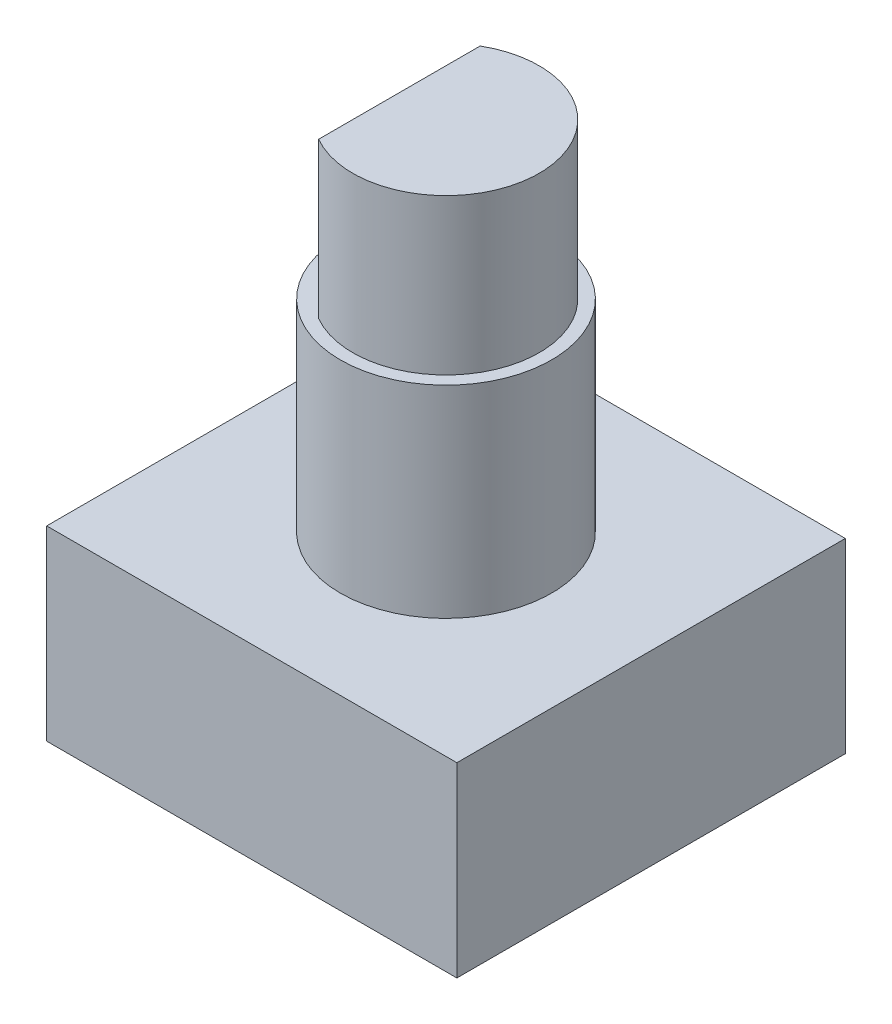
ISO-10303-21;
HEADER;
FILE_DESCRIPTION(('STEP AP214'),'2;1');
FILE_NAME('part.step','',(''),(''),'','','');
FILE_SCHEMA(('AUTOMOTIVE_DESIGN { 1 0 10303 214 1 1 1 1 }'));
ENDSEC;
DATA;
#1=APPLICATION_CONTEXT('core data for automotive mechanical design processes');
#2=APPLICATION_PROTOCOL_DEFINITION('international standard','automotive_design',2000,#1);
#3=PRODUCT_CONTEXT('',#1,'mechanical');
#4=PRODUCT('Part','Part','',(#3));
#5=PRODUCT_RELATED_PRODUCT_CATEGORY('part','',(#4));
#6=PRODUCT_DEFINITION_FORMATION('','',#4);
#7=PRODUCT_DEFINITION_CONTEXT('part definition',#1,'design');
#8=PRODUCT_DEFINITION('design','',#6,#7);
#9=PRODUCT_DEFINITION_SHAPE('','',#8);
#10=(LENGTH_UNIT() NAMED_UNIT(*) SI_UNIT(.MILLI.,.METRE.));
#11=(NAMED_UNIT(*) PLANE_ANGLE_UNIT() SI_UNIT($,.RADIAN.));
#12=(NAMED_UNIT(*) SI_UNIT($,.STERADIAN.) SOLID_ANGLE_UNIT());
#13=UNCERTAINTY_MEASURE_WITH_UNIT(LENGTH_MEASURE(1.E-05),#10,'distance_accuracy_value','');
#14=(GEOMETRIC_REPRESENTATION_CONTEXT(3) GLOBAL_UNCERTAINTY_ASSIGNED_CONTEXT((#13)) GLOBAL_UNIT_ASSIGNED_CONTEXT((#10,
#11,#12)) REPRESENTATION_CONTEXT('',''));
#15=CARTESIAN_POINT('',(0.,0.,0.));
#16=DIRECTION('',(0.,0.,1.));
#17=DIRECTION('',(1.,0.,0.));
#18=AXIS2_PLACEMENT_3D('',#15,#16,#17);
#19=CARTESIAN_POINT('',(6.6,6.,-6.25));
#20=DIRECTION('',(-1.,0.,0.));
#21=DIRECTION('',(0.,0.,1.));
#22=AXIS2_PLACEMENT_3D('',#19,#20,#21);
#23=PLANE('',#22);
#24=DIRECTION('',(0.,0.,-1.));
#25=VECTOR('',#24,1.);
#26=CARTESIAN_POINT('',(6.6,0.,-6.25));
#27=LINE('',#26,#25);
#28=CARTESIAN_POINT('',(6.6,0.,6.25));
#29=VERTEX_POINT('',#28);
#30=CARTESIAN_POINT('',(6.6,0.,-6.25));
#31=VERTEX_POINT('',#30);
#32=EDGE_CURVE('E116',#29,#31,#27,.T.);
#33=ORIENTED_EDGE('',*,*,#32,.T.);
#34=DIRECTION('',(0.,-1.,0.));
#35=VECTOR('',#34,1.);
#36=CARTESIAN_POINT('',(6.6,6.,-6.25));
#37=LINE('',#36,#35);
#38=CARTESIAN_POINT('',(6.6,6.,-6.25));
#39=VERTEX_POINT('',#38);
#40=EDGE_CURVE('E37',#39,#31,#37,.T.);
#41=ORIENTED_EDGE('',*,*,#40,.F.);
#42=DIRECTION('',(0.,0.,-1.));
#43=VECTOR('',#42,1.);
#44=CARTESIAN_POINT('',(6.6,6.,-6.25));
#45=LINE('',#44,#43);
#46=CARTESIAN_POINT('',(6.6,6.,6.25));
#47=VERTEX_POINT('',#46);
#48=EDGE_CURVE('E121',#47,#39,#45,.T.);
#49=ORIENTED_EDGE('',*,*,#48,.F.);
#50=DIRECTION('',(0.,-1.,0.));
#51=VECTOR('',#50,1.);
#52=CARTESIAN_POINT('',(6.6,6.,6.25));
#53=LINE('',#52,#51);
#54=EDGE_CURVE('E127',#47,#29,#53,.T.);
#55=ORIENTED_EDGE('',*,*,#54,.T.);
#56=EDGE_LOOP('',(#33,#41,#49,#55));
#57=FACE_BOUND('',#56,.T.);
#58=ADVANCED_FACE('F34',(#57),#23,.F.);
#59=CARTESIAN_POINT('',(-6.6,6.,-6.25));
#60=DIRECTION('',(0.,0.,1.));
#61=DIRECTION('',(1.,0.,0.));
#62=AXIS2_PLACEMENT_3D('',#59,#60,#61);
#63=PLANE('',#62);
#64=DIRECTION('',(-1.,0.,0.));
#65=VECTOR('',#64,1.);
#66=CARTESIAN_POINT('',(-6.6,0.,-6.25));
#67=LINE('',#66,#65);
#68=CARTESIAN_POINT('',(-6.6,0.,-6.25));
#69=VERTEX_POINT('',#68);
#70=EDGE_CURVE('E130',#31,#69,#67,.T.);
#71=ORIENTED_EDGE('',*,*,#70,.T.);
#72=DIRECTION('',(0.,-1.,0.));
#73=VECTOR('',#72,1.);
#74=CARTESIAN_POINT('',(-6.6,6.,-6.25));
#75=LINE('',#74,#73);
#76=CARTESIAN_POINT('',(-6.6,6.,-6.25));
#77=VERTEX_POINT('',#76);
#78=EDGE_CURVE('E137',#77,#69,#75,.T.);
#79=ORIENTED_EDGE('',*,*,#78,.F.);
#80=DIRECTION('',(-1.,0.,0.));
#81=VECTOR('',#80,1.);
#82=CARTESIAN_POINT('',(-6.6,6.,-6.25));
#83=LINE('',#82,#81);
#84=EDGE_CURVE('E86',#39,#77,#83,.T.);
#85=ORIENTED_EDGE('',*,*,#84,.F.);
#86=ORIENTED_EDGE('',*,*,#40,.T.);
#87=EDGE_LOOP('',(#71,#79,#85,#86));
#88=FACE_BOUND('',#87,.T.);
#89=ADVANCED_FACE('F143',(#88),#63,.F.);
#90=CARTESIAN_POINT('',(-6.6,6.,-6.25));
#91=DIRECTION('',(1.,0.,0.));
#92=DIRECTION('',(0.,0.,-1.));
#93=AXIS2_PLACEMENT_3D('',#90,#91,#92);
#94=PLANE('',#93);
#95=DIRECTION('',(0.,0.,1.));
#96=VECTOR('',#95,1.);
#97=CARTESIAN_POINT('',(-6.6,0.,-6.25));
#98=LINE('',#97,#96);
#99=CARTESIAN_POINT('',(-6.6,0.,6.25));
#100=VERTEX_POINT('',#99);
#101=EDGE_CURVE('E132',#69,#100,#98,.T.);
#102=ORIENTED_EDGE('',*,*,#101,.T.);
#103=DIRECTION('',(0.,-1.,0.));
#104=VECTOR('',#103,1.);
#105=CARTESIAN_POINT('',(-6.6,6.,6.25));
#106=LINE('',#105,#104);
#107=CARTESIAN_POINT('',(-6.6,6.,6.25));
#108=VERTEX_POINT('',#107);
#109=EDGE_CURVE('E136',#108,#100,#106,.T.);
#110=ORIENTED_EDGE('',*,*,#109,.F.);
#111=DIRECTION('',(0.,0.,1.));
#112=VECTOR('',#111,1.);
#113=CARTESIAN_POINT('',(-6.6,6.,-6.25));
#114=LINE('',#113,#112);
#115=EDGE_CURVE('E124',#77,#108,#114,.T.);
#116=ORIENTED_EDGE('',*,*,#115,.F.);
#117=ORIENTED_EDGE('',*,*,#78,.T.);
#118=EDGE_LOOP('',(#102,#110,#116,#117));
#119=FACE_BOUND('',#118,.T.);
#120=ADVANCED_FACE('F150',(#119),#94,.F.);
#121=CARTESIAN_POINT('',(-6.6,6.,6.25));
#122=DIRECTION('',(0.,0.,-1.));
#123=DIRECTION('',(-1.,0.,0.));
#124=AXIS2_PLACEMENT_3D('',#121,#122,#123);
#125=PLANE('',#124);
#126=DIRECTION('',(1.,0.,0.));
#127=VECTOR('',#126,1.);
#128=CARTESIAN_POINT('',(-6.6,0.,6.25));
#129=LINE('',#128,#127);
#130=EDGE_CURVE('E78',#100,#29,#129,.T.);
#131=ORIENTED_EDGE('',*,*,#130,.T.);
#132=ORIENTED_EDGE('',*,*,#54,.F.);
#133=DIRECTION('',(1.,0.,0.));
#134=VECTOR('',#133,1.);
#135=CARTESIAN_POINT('',(-6.6,6.,6.25));
#136=LINE('',#135,#134);
#137=EDGE_CURVE('E57',#108,#47,#136,.T.);
#138=ORIENTED_EDGE('',*,*,#137,.F.);
#139=ORIENTED_EDGE('',*,*,#109,.T.);
#140=EDGE_LOOP('',(#131,#132,#138,#139));
#141=FACE_BOUND('',#140,.T.);
#142=ADVANCED_FACE('F151',(#141),#125,.F.);
#143=CARTESIAN_POINT('',(0.,6.,0.));
#144=DIRECTION('',(0.,1.,0.));
#145=DIRECTION('',(0.,0.,1.));
#146=AXIS2_PLACEMENT_3D('',#143,#144,#145);
#147=PLANE('',#146);
#148=CARTESIAN_POINT('',(0.,6.,0.));
#149=DIRECTION('',(0.,1.,0.));
#150=DIRECTION('',(0.,0.,1.));
#151=AXIS2_PLACEMENT_3D('',#148,#149,#150);
#152=CIRCLE('',#151,3.4);
#153=CARTESIAN_POINT('',(0.,6.,3.4));
#154=VERTEX_POINT('',#153);
#155=EDGE_CURVE('E11',#154,#154,#152,.T.);
#156=ORIENTED_EDGE('',*,*,#155,.F.);
#157=EDGE_LOOP('',(#156));
#158=FACE_BOUND('',#157,.T.);
#159=ORIENTED_EDGE('',*,*,#48,.T.);
#160=ORIENTED_EDGE('',*,*,#84,.T.);
#161=ORIENTED_EDGE('',*,*,#115,.T.);
#162=ORIENTED_EDGE('',*,*,#137,.T.);
#163=EDGE_LOOP('',(#159,#160,#161,#162));
#164=FACE_BOUND('',#163,.T.);
#165=ADVANCED_FACE('F152',(#158,#164),#147,.T.);
#166=CARTESIAN_POINT('',(0.,0.,0.));
#167=DIRECTION('',(0.,1.,0.));
#168=DIRECTION('',(0.,0.,1.));
#169=AXIS2_PLACEMENT_3D('',#166,#167,#168);
#170=PLANE('',#169);
#171=ORIENTED_EDGE('',*,*,#32,.F.);
#172=ORIENTED_EDGE('',*,*,#130,.F.);
#173=ORIENTED_EDGE('',*,*,#101,.F.);
#174=ORIENTED_EDGE('',*,*,#70,.F.);
#175=EDGE_LOOP('',(#171,#172,#173,#174));
#176=FACE_BOUND('',#175,.T.);
#177=ADVANCED_FACE('F148',(#176),#170,.F.);
#178=CARTESIAN_POINT('',(0.,12.5,0.));
#179=DIRECTION('',(0.,-1.,0.));
#180=DIRECTION('',(0.,0.,-1.));
#181=AXIS2_PLACEMENT_3D('',#178,#179,#180);
#182=CYLINDRICAL_SURFACE('',#181,3.4);
#183=CARTESIAN_POINT('',(0.,12.5,0.));
#184=DIRECTION('',(0.,1.,0.));
#185=DIRECTION('',(0.,0.,1.));
#186=AXIS2_PLACEMENT_3D('',#183,#184,#185);
#187=CIRCLE('',#186,3.4);
#188=CARTESIAN_POINT('',(0.,12.5,3.4));
#189=VERTEX_POINT('',#188);
#190=EDGE_CURVE('E113',#189,#189,#187,.T.);
#191=ORIENTED_EDGE('',*,*,#190,.F.);
#192=EDGE_LOOP('',(#191));
#193=FACE_BOUND('',#192,.T.);
#194=ORIENTED_EDGE('',*,*,#155,.T.);
#195=EDGE_LOOP('',(#194));
#196=FACE_BOUND('',#195,.T.);
#197=ADVANCED_FACE('F160',(#193,#196),#182,.T.);
#198=CARTESIAN_POINT('',(0.,12.5,0.));
#199=DIRECTION('',(0.,1.,0.));
#200=DIRECTION('',(0.,0.,1.));
#201=AXIS2_PLACEMENT_3D('',#198,#199,#200);
#202=PLANE('',#201);
#203=CARTESIAN_POINT('',(0.,12.5,0.));
#204=DIRECTION('',(0.,1.,0.));
#205=DIRECTION('',(0.,0.,1.));
#206=AXIS2_PLACEMENT_3D('',#203,#204,#205);
#207=CIRCLE('',#206,3.);
#208=CARTESIAN_POINT('',(-1.5,12.5,2.59807621135332));
#209=VERTEX_POINT('',#208);
#210=CARTESIAN_POINT('',(-1.5,12.5,-2.59807621135332));
#211=VERTEX_POINT('',#210);
#212=EDGE_CURVE('E112',#209,#211,#207,.T.);
#213=ORIENTED_EDGE('',*,*,#212,.F.);
#214=DIRECTION('',(0.,0.,1.));
#215=VECTOR('',#214,1.);
#216=CARTESIAN_POINT('',(-1.5,12.5,2.59807621135332));
#217=LINE('',#216,#215);
#218=EDGE_CURVE('E48',#211,#209,#217,.T.);
#219=ORIENTED_EDGE('',*,*,#218,.F.);
#220=EDGE_LOOP('',(#213,#219));
#221=FACE_BOUND('',#220,.T.);
#222=ORIENTED_EDGE('',*,*,#190,.T.);
#223=EDGE_LOOP('',(#222));
#224=FACE_BOUND('',#223,.T.);
#225=ADVANCED_FACE('F198',(#221,#224),#202,.T.);
#226=CARTESIAN_POINT('',(0.,17.5,0.));
#227=DIRECTION('',(0.,-1.,0.));
#228=DIRECTION('',(0.,0.,-1.));
#229=AXIS2_PLACEMENT_3D('',#226,#227,#228);
#230=CYLINDRICAL_SURFACE('',#229,3.);
#231=ORIENTED_EDGE('',*,*,#212,.T.);
#232=DIRECTION('',(0.,-1.,0.));
#233=VECTOR('',#232,1.);
#234=CARTESIAN_POINT('',(-1.5,17.5,-2.59807621135332));
#235=LINE('',#234,#233);
#236=CARTESIAN_POINT('',(-1.5,17.5,-2.59807621135332));
#237=VERTEX_POINT('',#236);
#238=EDGE_CURVE('E100',#237,#211,#235,.T.);
#239=ORIENTED_EDGE('',*,*,#238,.F.);
#240=CARTESIAN_POINT('',(0.,17.5,0.));
#241=DIRECTION('',(0.,1.,0.));
#242=DIRECTION('',(0.,0.,1.));
#243=AXIS2_PLACEMENT_3D('',#240,#241,#242);
#244=CIRCLE('',#243,3.);
#245=CARTESIAN_POINT('',(-1.5,17.5,2.59807621135332));
#246=VERTEX_POINT('',#245);
#247=EDGE_CURVE('E106',#246,#237,#244,.T.);
#248=ORIENTED_EDGE('',*,*,#247,.F.);
#249=DIRECTION('',(0.,-1.,0.));
#250=VECTOR('',#249,1.);
#251=CARTESIAN_POINT('',(-1.5,17.5,2.59807621135332));
#252=LINE('',#251,#250);
#253=EDGE_CURVE('E103',#246,#209,#252,.T.);
#254=ORIENTED_EDGE('',*,*,#253,.T.);
#255=EDGE_LOOP('',(#231,#239,#248,#254));
#256=FACE_BOUND('',#255,.T.);
#257=ADVANCED_FACE('F111',(#256),#230,.T.);
#258=CARTESIAN_POINT('',(-1.5,17.5,2.59807621135332));
#259=DIRECTION('',(1.,0.,0.));
#260=DIRECTION('',(0.,0.,-1.));
#261=AXIS2_PLACEMENT_3D('',#258,#259,#260);
#262=PLANE('',#261);
#263=ORIENTED_EDGE('',*,*,#218,.T.);
#264=ORIENTED_EDGE('',*,*,#253,.F.);
#265=DIRECTION('',(0.,0.,1.));
#266=VECTOR('',#265,1.);
#267=CARTESIAN_POINT('',(-1.5,17.5,2.59807621135332));
#268=LINE('',#267,#266);
#269=EDGE_CURVE('E96',#237,#246,#268,.T.);
#270=ORIENTED_EDGE('',*,*,#269,.F.);
#271=ORIENTED_EDGE('',*,*,#238,.T.);
#272=EDGE_LOOP('',(#263,#264,#270,#271));
#273=FACE_BOUND('',#272,.T.);
#274=ADVANCED_FACE('F98',(#273),#262,.F.);
#275=CARTESIAN_POINT('',(0.,17.5,0.));
#276=DIRECTION('',(0.,1.,0.));
#277=DIRECTION('',(0.,0.,1.));
#278=AXIS2_PLACEMENT_3D('',#275,#276,#277);
#279=PLANE('',#278);
#280=ORIENTED_EDGE('',*,*,#247,.T.);
#281=ORIENTED_EDGE('',*,*,#269,.T.);
#282=EDGE_LOOP('',(#280,#281));
#283=FACE_BOUND('',#282,.T.);
#284=ADVANCED_FACE('F108',(#283),#279,.T.);
#285=CLOSED_SHELL('',(#58,#89,#120,#142,#165,#177,#197,#225,#257,#274,#284));
#286=MANIFOLD_SOLID_BREP('B2',#285);
#287=ADVANCED_BREP_SHAPE_REPRESENTATION('',(#18,#286),#14);
#288=SHAPE_DEFINITION_REPRESENTATION(#9,#287);
ENDSEC;
END-ISO-10303-21;
